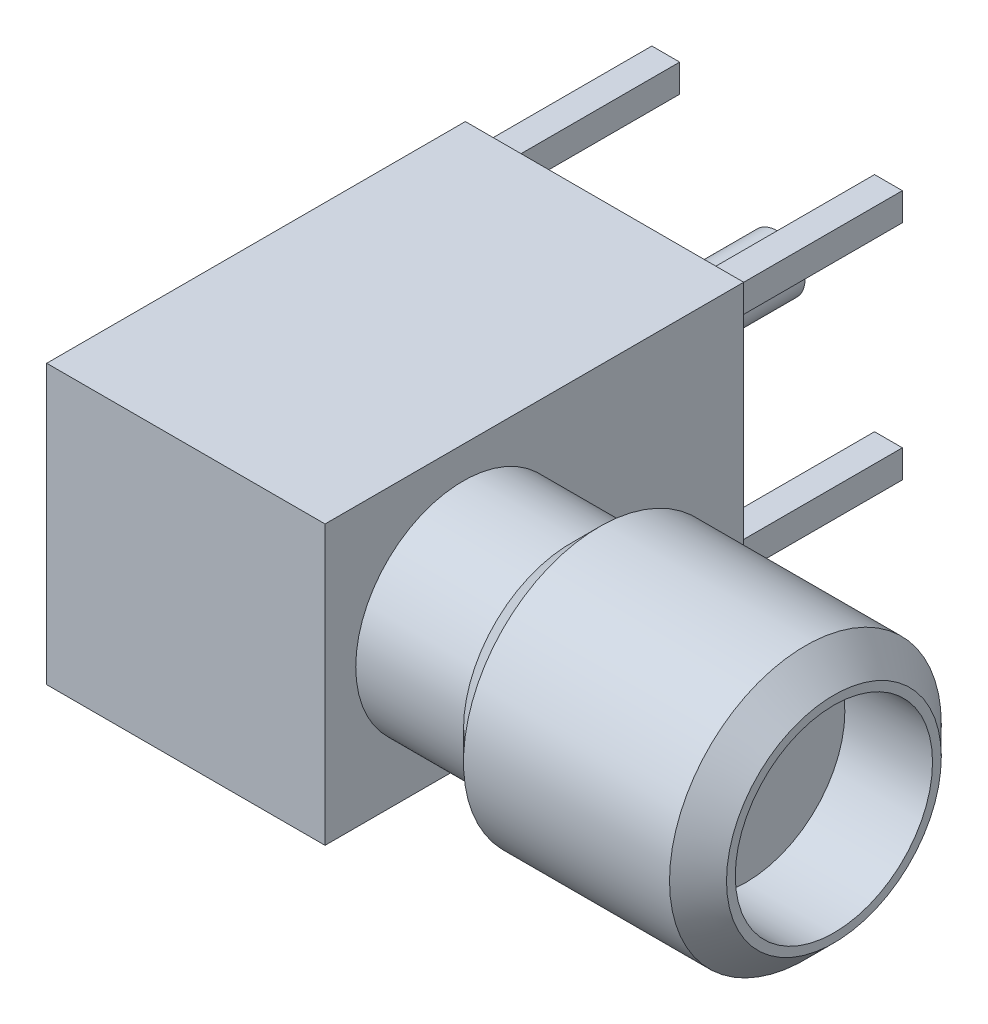
ISO-10303-21;
HEADER;
FILE_DESCRIPTION(('STEP AP214'),'2;1');
FILE_NAME('part.step','',(''),(''),'','','');
FILE_SCHEMA(('AUTOMOTIVE_DESIGN { 1 0 10303 214 1 1 1 1 }'));
ENDSEC;
DATA;
#1=APPLICATION_CONTEXT('core data for automotive mechanical design processes');
#2=APPLICATION_PROTOCOL_DEFINITION('international standard','automotive_design',2000,#1);
#3=PRODUCT_CONTEXT('',#1,'mechanical');
#4=PRODUCT('Part','Part','',(#3));
#5=PRODUCT_RELATED_PRODUCT_CATEGORY('part','',(#4));
#6=PRODUCT_DEFINITION_FORMATION('','',#4);
#7=PRODUCT_DEFINITION_CONTEXT('part definition',#1,'design');
#8=PRODUCT_DEFINITION('design','',#6,#7);
#9=PRODUCT_DEFINITION_SHAPE('','',#8);
#10=(LENGTH_UNIT() NAMED_UNIT(*) SI_UNIT(.MILLI.,.METRE.));
#11=(NAMED_UNIT(*) PLANE_ANGLE_UNIT() SI_UNIT($,.RADIAN.));
#12=(NAMED_UNIT(*) SI_UNIT($,.STERADIAN.) SOLID_ANGLE_UNIT());
#13=UNCERTAINTY_MEASURE_WITH_UNIT(LENGTH_MEASURE(1.E-05),#10,'distance_accuracy_value','');
#14=(GEOMETRIC_REPRESENTATION_CONTEXT(3) GLOBAL_UNCERTAINTY_ASSIGNED_CONTEXT((#13)) GLOBAL_UNIT_ASSIGNED_CONTEXT((#10,
#11,#12)) REPRESENTATION_CONTEXT('',''));
#15=CARTESIAN_POINT('',(0.,0.,0.));
#16=DIRECTION('',(0.,0.,1.));
#17=DIRECTION('',(1.,0.,0.));
#18=AXIS2_PLACEMENT_3D('',#15,#16,#17);
#19=CARTESIAN_POINT('',(8.6332,0.,6.4008));
#20=DIRECTION('',(-1.,0.,0.));
#21=DIRECTION('',(0.,0.,1.));
#22=AXIS2_PLACEMENT_3D('',#19,#20,#21);
#23=PLANE('',#22);
#24=CARTESIAN_POINT('',(8.6332,0.,6.4008));
#25=DIRECTION('',(-1.,0.,0.));
#26=DIRECTION('',(0.,0.,1.));
#27=AXIS2_PLACEMENT_3D('',#24,#25,#26);
#28=CIRCLE('',#27,0.5);
#29=CARTESIAN_POINT('',(8.6332,0.,6.9008));
#30=VERTEX_POINT('',#29);
#31=EDGE_CURVE('E20',#30,#30,#28,.F.);
#32=ORIENTED_EDGE('',*,*,#31,.T.);
#33=EDGE_LOOP('',(#32));
#34=FACE_BOUND('',#33,.T.);
#35=ADVANCED_FACE('F17',(#34),#23,.F.);
#36=CARTESIAN_POINT('',(9.6332,0.,6.4008));
#37=DIRECTION('',(-1.,0.,0.));
#38=DIRECTION('',(0.,0.,1.));
#39=AXIS2_PLACEMENT_3D('',#36,#37,#38);
#40=CYLINDRICAL_SURFACE('',#39,0.5);
#41=CARTESIAN_POINT('',(9.6332,0.,6.4008));
#42=DIRECTION('',(-1.,0.,0.));
#43=DIRECTION('',(0.,0.,1.));
#44=AXIS2_PLACEMENT_3D('',#41,#42,#43);
#45=CIRCLE('',#44,0.5);
#46=CARTESIAN_POINT('',(9.6332,0.,6.9008));
#47=VERTEX_POINT('',#46);
#48=EDGE_CURVE('E218',#47,#47,#45,.F.);
#49=ORIENTED_EDGE('',*,*,#48,.T.);
#50=EDGE_LOOP('',(#49));
#51=FACE_BOUND('',#50,.T.);
#52=ORIENTED_EDGE('',*,*,#31,.F.);
#53=EDGE_LOOP('',(#52));
#54=FACE_BOUND('',#53,.T.);
#55=ADVANCED_FACE('F226',(#51,#54),#40,.F.);
#56=CARTESIAN_POINT('',(9.6332,0.,6.4008));
#57=DIRECTION('',(-1.,0.,0.));
#58=DIRECTION('',(0.,0.,1.));
#59=AXIS2_PLACEMENT_3D('',#56,#57,#58);
#60=PLANE('',#59);
#61=ORIENTED_EDGE('',*,*,#48,.F.);
#62=EDGE_LOOP('',(#61));
#63=FACE_BOUND('',#62,.T.);
#64=CARTESIAN_POINT('',(9.6332,0.,6.4008));
#65=DIRECTION('',(1.,0.,0.));
#66=DIRECTION('',(0.,0.,-1.));
#67=AXIS2_PLACEMENT_3D('',#64,#65,#66);
#68=CIRCLE('',#67,2.25);
#69=CARTESIAN_POINT('',(9.6332,0.,4.1508));
#70=VERTEX_POINT('',#69);
#71=EDGE_CURVE('E216',#70,#70,#68,.T.);
#72=ORIENTED_EDGE('',*,*,#71,.T.);
#73=EDGE_LOOP('',(#72));
#74=FACE_BOUND('',#73,.T.);
#75=ADVANCED_FACE('F228',(#63,#74),#60,.F.);
#76=CARTESIAN_POINT('',(9.6332,0.,6.4008));
#77=DIRECTION('',(1.,0.,0.));
#78=DIRECTION('',(0.,0.,-1.));
#79=AXIS2_PLACEMENT_3D('',#76,#77,#78);
#80=CYLINDRICAL_SURFACE('',#79,2.25);
#81=ORIENTED_EDGE('',*,*,#71,.F.);
#82=EDGE_LOOP('',(#81));
#83=FACE_BOUND('',#82,.T.);
#84=CARTESIAN_POINT('',(11.6332,0.,6.4008));
#85=DIRECTION('',(1.,0.,0.));
#86=DIRECTION('',(0.,0.,-1.));
#87=AXIS2_PLACEMENT_3D('',#84,#85,#86);
#88=CIRCLE('',#87,2.25);
#89=CARTESIAN_POINT('',(11.6332,0.,4.1508));
#90=VERTEX_POINT('',#89);
#91=EDGE_CURVE('E213',#90,#90,#88,.F.);
#92=ORIENTED_EDGE('',*,*,#91,.F.);
#93=EDGE_LOOP('',(#92));
#94=FACE_BOUND('',#93,.T.);
#95=ADVANCED_FACE('F234',(#83,#94),#80,.F.);
#96=CARTESIAN_POINT('',(11.6332,0.,6.4008));
#97=DIRECTION('',(1.,0.,0.));
#98=DIRECTION('',(0.,0.,-1.));
#99=AXIS2_PLACEMENT_3D('',#96,#97,#98);
#100=PLANE('',#99);
#101=CARTESIAN_POINT('',(11.6331999999488,0.,6.4008));
#102=DIRECTION('',(-1.,0.,0.));
#103=DIRECTION('',(0.,0.,1.));
#104=AXIS2_PLACEMENT_3D('',#101,#102,#103);
#105=CIRCLE('',#104,2.45000000000471);
#106=CARTESIAN_POINT('',(11.6331999999488,0.,8.85080000000471));
#107=VERTEX_POINT('',#106);
#108=EDGE_CURVE('E196',#107,#107,#105,.T.);
#109=ORIENTED_EDGE('',*,*,#108,.F.);
#110=EDGE_LOOP('',(#109));
#111=FACE_BOUND('',#110,.T.);
#112=ORIENTED_EDGE('',*,*,#91,.T.);
#113=EDGE_LOOP('',(#112));
#114=FACE_BOUND('',#113,.T.);
#115=ADVANCED_FACE('F362',(#111,#114),#100,.T.);
#116=CARTESIAN_POINT('',(10.9832000000551,0.,6.4008));
#117=DIRECTION('',(-1.,0.,0.));
#118=DIRECTION('',(0.,0.,1.));
#119=AXIS2_PLACEMENT_3D('',#116,#117,#118);
#120=CONICAL_SURFACE('',#119,3.09999999989839,0.785398163397448);
#121=ORIENTED_EDGE('',*,*,#108,.T.);
#122=EDGE_LOOP('',(#121));
#123=FACE_BOUND('',#122,.T.);
#124=CARTESIAN_POINT('',(10.9832,0.,6.4008));
#125=DIRECTION('',(1.,0.,0.));
#126=DIRECTION('',(0.,0.,-1.));
#127=AXIS2_PLACEMENT_3D('',#124,#125,#126);
#128=CIRCLE('',#127,3.1);
#129=CARTESIAN_POINT('',(10.9832,0.,3.3008));
#130=VERTEX_POINT('',#129);
#131=EDGE_CURVE('E171',#130,#130,#128,.F.);
#132=ORIENTED_EDGE('',*,*,#131,.F.);
#133=EDGE_LOOP('',(#132));
#134=FACE_BOUND('',#133,.T.);
#135=ADVANCED_FACE('F358',(#123,#134),#120,.T.);
#136=CARTESIAN_POINT('',(5.6332,0.,6.4008));
#137=DIRECTION('',(1.,0.,0.));
#138=DIRECTION('',(0.,0.,-1.));
#139=AXIS2_PLACEMENT_3D('',#136,#137,#138);
#140=CYLINDRICAL_SURFACE('',#139,3.1);
#141=CARTESIAN_POINT('',(6.28319999998439,0.,6.4008));
#142=DIRECTION('',(1.,0.,0.));
#143=DIRECTION('',(0.,0.,-1.));
#144=AXIS2_PLACEMENT_3D('',#141,#142,#143);
#145=CIRCLE('',#144,3.10000000002321);
#146=CARTESIAN_POINT('',(6.28319999998439,0.,3.30079999997679));
#147=VERTEX_POINT('',#146);
#148=EDGE_CURVE('E164',#147,#147,#145,.F.);
#149=ORIENTED_EDGE('',*,*,#148,.F.);
#150=EDGE_LOOP('',(#149));
#151=FACE_BOUND('',#150,.T.);
#152=ORIENTED_EDGE('',*,*,#131,.T.);
#153=EDGE_LOOP('',(#152));
#154=FACE_BOUND('',#153,.T.);
#155=ADVANCED_FACE('F355',(#151,#154),#140,.T.);
#156=CARTESIAN_POINT('',(2.2225,-2.8575,-4.835025612107));
#157=DIRECTION('',(1.,0.,0.));
#158=DIRECTION('',(0.,0.,-1.));
#159=AXIS2_PLACEMENT_3D('',#156,#157,#158);
#160=PLANE('',#159);
#161=DIRECTION('',(0.,1.,0.));
#162=VECTOR('',#161,1.);
#163=CARTESIAN_POINT('',(2.2225,-3.155,-3.937));
#164=LINE('',#163,#162);
#165=CARTESIAN_POINT('',(2.2225,-2.2225,-3.937));
#166=VERTEX_POINT('',#165);
#167=CARTESIAN_POINT('',(2.2225,-2.8575,-3.937));
#168=VERTEX_POINT('',#167);
#169=EDGE_CURVE('E178',#166,#168,#164,.F.);
#170=ORIENTED_EDGE('',*,*,#169,.T.);
#171=DIRECTION('',(0.,0.,1.));
#172=VECTOR('',#171,1.);
#173=CARTESIAN_POINT('',(2.2225,-2.8575,-4.835025612107));
#174=LINE('',#173,#172);
#175=CARTESIAN_POINT('',(2.2225,-2.8575,0.));
#176=VERTEX_POINT('',#175);
#177=EDGE_CURVE('E168',#168,#176,#174,.T.);
#178=ORIENTED_EDGE('',*,*,#177,.T.);
#179=DIRECTION('',(0.,1.,0.));
#180=VECTOR('',#179,1.);
#181=CARTESIAN_POINT('',(2.2225,-2.8575,0.));
#182=LINE('',#181,#180);
#183=CARTESIAN_POINT('',(2.2225,-2.2225,0.));
#184=VERTEX_POINT('',#183);
#185=EDGE_CURVE('E158',#184,#176,#182,.F.);
#186=ORIENTED_EDGE('',*,*,#185,.F.);
#187=DIRECTION('',(0.,0.,-1.));
#188=VECTOR('',#187,1.);
#189=CARTESIAN_POINT('',(2.2225,-2.2225,-4.835025612107));
#190=LINE('',#189,#188);
#191=EDGE_CURVE('E151',#184,#166,#190,.T.);
#192=ORIENTED_EDGE('',*,*,#191,.T.);
#193=EDGE_LOOP('',(#170,#178,#186,#192));
#194=FACE_BOUND('',#193,.T.);
#195=ADVANCED_FACE('F166',(#194),#160,.F.);
#196=CARTESIAN_POINT('',(-2.2225,2.8575,-4.835025612107));
#197=DIRECTION('',(-1.,0.,0.));
#198=DIRECTION('',(0.,0.,1.));
#199=AXIS2_PLACEMENT_3D('',#196,#197,#198);
#200=PLANE('',#199);
#201=DIRECTION('',(0.,1.,0.));
#202=VECTOR('',#201,1.);
#203=CARTESIAN_POINT('',(-2.2225,-3.155,-3.937));
#204=LINE('',#203,#202);
#205=CARTESIAN_POINT('',(-2.2225,2.2225,-3.937));
#206=VERTEX_POINT('',#205);
#207=CARTESIAN_POINT('',(-2.2225,2.8575,-3.937));
#208=VERTEX_POINT('',#207);
#209=EDGE_CURVE('E607',#206,#208,#204,.T.);
#210=ORIENTED_EDGE('',*,*,#209,.T.);
#211=DIRECTION('',(0.,0.,-1.));
#212=VECTOR('',#211,1.);
#213=CARTESIAN_POINT('',(-2.2225,2.8575,-4.835025612107));
#214=LINE('',#213,#212);
#215=CARTESIAN_POINT('',(-2.2225,2.8575,0.));
#216=VERTEX_POINT('',#215);
#217=EDGE_CURVE('E611',#208,#216,#214,.F.);
#218=ORIENTED_EDGE('',*,*,#217,.T.);
#219=DIRECTION('',(0.,1.,0.));
#220=VECTOR('',#219,1.);
#221=CARTESIAN_POINT('',(-2.2225,2.8575,0.));
#222=LINE('',#221,#220);
#223=CARTESIAN_POINT('',(-2.2225,2.2225,0.));
#224=VERTEX_POINT('',#223);
#225=EDGE_CURVE('E170',#224,#216,#222,.T.);
#226=ORIENTED_EDGE('',*,*,#225,.F.);
#227=DIRECTION('',(0.,0.,1.));
#228=VECTOR('',#227,1.);
#229=CARTESIAN_POINT('',(-2.2225,2.2225,-4.835025612107));
#230=LINE('',#229,#228);
#231=EDGE_CURVE('E614',#224,#206,#230,.F.);
#232=ORIENTED_EDGE('',*,*,#231,.T.);
#233=EDGE_LOOP('',(#210,#218,#226,#232));
#234=FACE_BOUND('',#233,.T.);
#235=ADVANCED_FACE('F348',(#234),#200,.F.);
#236=CARTESIAN_POINT('',(2.8575,2.2225,-4.835025612107));
#237=DIRECTION('',(0.,1.,0.));
#238=DIRECTION('',(0.,0.,1.));
#239=AXIS2_PLACEMENT_3D('',#236,#237,#238);
#240=PLANE('',#239);
#241=DIRECTION('',(1.,0.,0.));
#242=VECTOR('',#241,1.);
#243=CARTESIAN_POINT('',(-3.155,2.2225,-3.937));
#244=LINE('',#243,#242);
#245=CARTESIAN_POINT('',(2.2225,2.2225,-3.937));
#246=VERTEX_POINT('',#245);
#247=CARTESIAN_POINT('',(2.8575,2.2225,-3.937));
#248=VERTEX_POINT('',#247);
#249=EDGE_CURVE('E698',#246,#248,#244,.T.);
#250=ORIENTED_EDGE('',*,*,#249,.T.);
#251=DIRECTION('',(0.,0.,1.));
#252=VECTOR('',#251,1.);
#253=CARTESIAN_POINT('',(2.8575,2.2225,-4.835025612107));
#254=LINE('',#253,#252);
#255=CARTESIAN_POINT('',(2.8575,2.2225,0.));
#256=VERTEX_POINT('',#255);
#257=EDGE_CURVE('E690',#248,#256,#254,.T.);
#258=ORIENTED_EDGE('',*,*,#257,.T.);
#259=DIRECTION('',(1.,0.,0.));
#260=VECTOR('',#259,1.);
#261=CARTESIAN_POINT('',(2.8575,2.2225,0.));
#262=LINE('',#261,#260);
#263=CARTESIAN_POINT('',(2.2225,2.2225,0.));
#264=VERTEX_POINT('',#263);
#265=EDGE_CURVE('E189',#264,#256,#262,.T.);
#266=ORIENTED_EDGE('',*,*,#265,.F.);
#267=DIRECTION('',(0.,0.,-1.));
#268=VECTOR('',#267,1.);
#269=CARTESIAN_POINT('',(2.2225,2.2225,-4.835025612107));
#270=LINE('',#269,#268);
#271=EDGE_CURVE('E629',#264,#246,#270,.T.);
#272=ORIENTED_EDGE('',*,*,#271,.T.);
#273=EDGE_LOOP('',(#250,#258,#266,#272));
#274=FACE_BOUND('',#273,.T.);
#275=ADVANCED_FACE('F344',(#274),#240,.F.);
#276=CARTESIAN_POINT('',(-2.8575,-2.2225,-4.835025612107));
#277=DIRECTION('',(0.,-1.,0.));
#278=DIRECTION('',(0.,0.,-1.));
#279=AXIS2_PLACEMENT_3D('',#276,#277,#278);
#280=PLANE('',#279);
#281=DIRECTION('',(1.,0.,0.));
#282=VECTOR('',#281,1.);
#283=CARTESIAN_POINT('',(-3.155,-2.2225,-3.937));
#284=LINE('',#283,#282);
#285=CARTESIAN_POINT('',(-2.2225,-2.2225,-3.937));
#286=VERTEX_POINT('',#285);
#287=CARTESIAN_POINT('',(-2.8575,-2.2225,-3.937));
#288=VERTEX_POINT('',#287);
#289=EDGE_CURVE('E681',#286,#288,#284,.F.);
#290=ORIENTED_EDGE('',*,*,#289,.T.);
#291=DIRECTION('',(0.,0.,-1.));
#292=VECTOR('',#291,1.);
#293=CARTESIAN_POINT('',(-2.8575,-2.2225,-4.835025612107));
#294=LINE('',#293,#292);
#295=CARTESIAN_POINT('',(-2.8575,-2.2225,0.));
#296=VERTEX_POINT('',#295);
#297=EDGE_CURVE('E186',#288,#296,#294,.F.);
#298=ORIENTED_EDGE('',*,*,#297,.T.);
#299=DIRECTION('',(1.,0.,0.));
#300=VECTOR('',#299,1.);
#301=CARTESIAN_POINT('',(-2.8575,-2.2225,0.));
#302=LINE('',#301,#300);
#303=CARTESIAN_POINT('',(-2.2225,-2.2225,0.));
#304=VERTEX_POINT('',#303);
#305=EDGE_CURVE('E187',#304,#296,#302,.F.);
#306=ORIENTED_EDGE('',*,*,#305,.F.);
#307=DIRECTION('',(0.,0.,1.));
#308=VECTOR('',#307,1.);
#309=CARTESIAN_POINT('',(-2.2225,-2.2225,-4.835025612107));
#310=LINE('',#309,#308);
#311=EDGE_CURVE('E686',#304,#286,#310,.F.);
#312=ORIENTED_EDGE('',*,*,#311,.T.);
#313=EDGE_LOOP('',(#290,#298,#306,#312));
#314=FACE_BOUND('',#313,.T.);
#315=ADVANCED_FACE('F340',(#314),#280,.F.);
#316=CARTESIAN_POINT('',(6.28320000015492,0.,6.4008));
#317=DIRECTION('',(1.,0.,0.));
#318=DIRECTION('',(0.,1.,0.));
#319=AXIS2_PLACEMENT_3D('',#316,#317,#318);
#320=CONICAL_SURFACE('',#319,3.10000000019374,0.785398163397448);
#321=CARTESIAN_POINT('',(5.6332,0.,6.4008));
#322=DIRECTION('',(1.,0.,0.));
#323=DIRECTION('',(0.,0.,-1.));
#324=AXIS2_PLACEMENT_3D('',#321,#322,#323);
#325=CIRCLE('',#324,2.45);
#326=CARTESIAN_POINT('',(5.6332,0.,3.9508));
#327=VERTEX_POINT('',#326);
#328=EDGE_CURVE('E182',#327,#327,#325,.F.);
#329=ORIENTED_EDGE('',*,*,#328,.F.);
#330=EDGE_LOOP('',(#329));
#331=FACE_BOUND('',#330,.T.);
#332=ORIENTED_EDGE('',*,*,#148,.T.);
#333=EDGE_LOOP('',(#332));
#334=FACE_BOUND('',#333,.T.);
#335=ADVANCED_FACE('F337',(#331,#334),#320,.T.);
#336=CARTESIAN_POINT('',(2.8575,-2.2225,-4.835025612107));
#337=DIRECTION('',(0.,-1.,0.));
#338=DIRECTION('',(0.,0.,-1.));
#339=AXIS2_PLACEMENT_3D('',#336,#337,#338);
#340=PLANE('',#339);
#341=DIRECTION('',(1.,0.,0.));
#342=VECTOR('',#341,1.);
#343=CARTESIAN_POINT('',(-3.155,-2.2225,-3.937));
#344=LINE('',#343,#342);
#345=CARTESIAN_POINT('',(2.8575,-2.2225,-3.937));
#346=VERTEX_POINT('',#345);
#347=EDGE_CURVE('E175',#346,#166,#344,.F.);
#348=ORIENTED_EDGE('',*,*,#347,.T.);
#349=ORIENTED_EDGE('',*,*,#191,.F.);
#350=DIRECTION('',(1.,0.,0.));
#351=VECTOR('',#350,1.);
#352=CARTESIAN_POINT('',(2.8575,-2.2225,0.));
#353=LINE('',#352,#351);
#354=CARTESIAN_POINT('',(2.8575,-2.2225,0.));
#355=VERTEX_POINT('',#354);
#356=EDGE_CURVE('E156',#355,#184,#353,.F.);
#357=ORIENTED_EDGE('',*,*,#356,.F.);
#358=DIRECTION('',(0.,0.,1.));
#359=VECTOR('',#358,1.);
#360=CARTESIAN_POINT('',(2.8575,-2.2225,-4.835025612107));
#361=LINE('',#360,#359);
#362=EDGE_CURVE('E185',#355,#346,#361,.F.);
#363=ORIENTED_EDGE('',*,*,#362,.T.);
#364=EDGE_LOOP('',(#348,#349,#357,#363));
#365=FACE_BOUND('',#364,.T.);
#366=ADVANCED_FACE('F173',(#365),#340,.F.);
#367=CARTESIAN_POINT('',(-3.155,-3.155,-3.937));
#368=DIRECTION('',(0.,0.,1.));
#369=DIRECTION('',(1.,0.,0.));
#370=AXIS2_PLACEMENT_3D('',#367,#368,#369);
#371=PLANE('',#370);
#372=ORIENTED_EDGE('',*,*,#347,.F.);
#373=DIRECTION('',(0.,1.,0.));
#374=VECTOR('',#373,1.);
#375=CARTESIAN_POINT('',(2.8575,-2.8575,-3.937));
#376=LINE('',#375,#374);
#377=CARTESIAN_POINT('',(2.8575,-2.8575,-3.937));
#378=VERTEX_POINT('',#377);
#379=EDGE_CURVE('E645',#346,#378,#376,.F.);
#380=ORIENTED_EDGE('',*,*,#379,.T.);
#381=DIRECTION('',(1.,0.,0.));
#382=VECTOR('',#381,1.);
#383=CARTESIAN_POINT('',(2.8575,-2.8575,-3.937));
#384=LINE('',#383,#382);
#385=EDGE_CURVE('E639',#378,#168,#384,.F.);
#386=ORIENTED_EDGE('',*,*,#385,.T.);
#387=ORIENTED_EDGE('',*,*,#169,.F.);
#388=EDGE_LOOP('',(#372,#380,#386,#387));
#389=FACE_BOUND('',#388,.T.);
#390=ADVANCED_FACE('F330',(#389),#371,.F.);
#391=CARTESIAN_POINT('',(2.8575,-2.8575,-4.835025612107));
#392=DIRECTION('',(0.,1.,0.));
#393=DIRECTION('',(0.,0.,1.));
#394=AXIS2_PLACEMENT_3D('',#391,#392,#393);
#395=PLANE('',#394);
#396=ORIENTED_EDGE('',*,*,#385,.F.);
#397=DIRECTION('',(0.,0.,1.));
#398=VECTOR('',#397,1.);
#399=CARTESIAN_POINT('',(2.8575,-2.8575,-4.835025612107));
#400=LINE('',#399,#398);
#401=CARTESIAN_POINT('',(2.8575,-2.8575,0.));
#402=VERTEX_POINT('',#401);
#403=EDGE_CURVE('E648',#378,#402,#400,.T.);
#404=ORIENTED_EDGE('',*,*,#403,.T.);
#405=DIRECTION('',(1.,0.,0.));
#406=VECTOR('',#405,1.);
#407=CARTESIAN_POINT('',(2.8575,-2.8575,0.));
#408=LINE('',#407,#406);
#409=EDGE_CURVE('E642',#176,#402,#408,.T.);
#410=ORIENTED_EDGE('',*,*,#409,.F.);
#411=ORIENTED_EDGE('',*,*,#177,.F.);
#412=EDGE_LOOP('',(#396,#404,#410,#411));
#413=FACE_BOUND('',#412,.T.);
#414=ADVANCED_FACE('F326',(#413),#395,.F.);
#415=CARTESIAN_POINT('',(-2.8575,2.2225,-4.835025612107));
#416=DIRECTION('',(0.,1.,0.));
#417=DIRECTION('',(0.,0.,1.));
#418=AXIS2_PLACEMENT_3D('',#415,#416,#417);
#419=PLANE('',#418);
#420=DIRECTION('',(1.,0.,0.));
#421=VECTOR('',#420,1.);
#422=CARTESIAN_POINT('',(-3.155,2.2225,-3.937));
#423=LINE('',#422,#421);
#424=CARTESIAN_POINT('',(-2.8575,2.2225,-3.937));
#425=VERTEX_POINT('',#424);
#426=EDGE_CURVE('E618',#425,#206,#423,.T.);
#427=ORIENTED_EDGE('',*,*,#426,.T.);
#428=ORIENTED_EDGE('',*,*,#231,.F.);
#429=DIRECTION('',(1.,0.,0.));
#430=VECTOR('',#429,1.);
#431=CARTESIAN_POINT('',(-2.8575,2.2225,0.));
#432=LINE('',#431,#430);
#433=CARTESIAN_POINT('',(-2.8575,2.2225,0.));
#434=VERTEX_POINT('',#433);
#435=EDGE_CURVE('E636',#434,#224,#432,.T.);
#436=ORIENTED_EDGE('',*,*,#435,.F.);
#437=DIRECTION('',(0.,0.,-1.));
#438=VECTOR('',#437,1.);
#439=CARTESIAN_POINT('',(-2.8575,2.2225,-4.835025612107));
#440=LINE('',#439,#438);
#441=EDGE_CURVE('E649',#434,#425,#440,.T.);
#442=ORIENTED_EDGE('',*,*,#441,.T.);
#443=EDGE_LOOP('',(#427,#428,#436,#442));
#444=FACE_BOUND('',#443,.T.);
#445=ADVANCED_FACE('F322',(#444),#419,.F.);
#446=CARTESIAN_POINT('',(-3.155,-3.155,-3.937));
#447=DIRECTION('',(0.,0.,1.));
#448=DIRECTION('',(1.,0.,0.));
#449=AXIS2_PLACEMENT_3D('',#446,#447,#448);
#450=PLANE('',#449);
#451=ORIENTED_EDGE('',*,*,#426,.F.);
#452=DIRECTION('',(0.,1.,0.));
#453=VECTOR('',#452,1.);
#454=CARTESIAN_POINT('',(-2.8575,2.8575,-3.937));
#455=LINE('',#454,#453);
#456=CARTESIAN_POINT('',(-2.8575,2.8575,-3.937));
#457=VERTEX_POINT('',#456);
#458=EDGE_CURVE('E623',#425,#457,#455,.T.);
#459=ORIENTED_EDGE('',*,*,#458,.T.);
#460=DIRECTION('',(1.,0.,0.));
#461=VECTOR('',#460,1.);
#462=CARTESIAN_POINT('',(-2.8575,2.8575,-3.937));
#463=LINE('',#462,#461);
#464=EDGE_CURVE('E621',#457,#208,#463,.T.);
#465=ORIENTED_EDGE('',*,*,#464,.T.);
#466=ORIENTED_EDGE('',*,*,#209,.F.);
#467=EDGE_LOOP('',(#451,#459,#465,#466));
#468=FACE_BOUND('',#467,.T.);
#469=ADVANCED_FACE('F318',(#468),#450,.F.);
#470=CARTESIAN_POINT('',(-2.8575,2.8575,-4.835025612107));
#471=DIRECTION('',(0.,-1.,0.));
#472=DIRECTION('',(0.,0.,-1.));
#473=AXIS2_PLACEMENT_3D('',#470,#471,#472);
#474=PLANE('',#473);
#475=ORIENTED_EDGE('',*,*,#464,.F.);
#476=DIRECTION('',(0.,0.,-1.));
#477=VECTOR('',#476,1.);
#478=CARTESIAN_POINT('',(-2.8575,2.8575,-4.835025612107));
#479=LINE('',#478,#477);
#480=CARTESIAN_POINT('',(-2.8575,2.8575,0.));
#481=VERTEX_POINT('',#480);
#482=EDGE_CURVE('E210',#457,#481,#479,.F.);
#483=ORIENTED_EDGE('',*,*,#482,.T.);
#484=DIRECTION('',(1.,0.,0.));
#485=VECTOR('',#484,1.);
#486=CARTESIAN_POINT('',(-2.8575,2.8575,0.));
#487=LINE('',#486,#485);
#488=EDGE_CURVE('E617',#216,#481,#487,.F.);
#489=ORIENTED_EDGE('',*,*,#488,.F.);
#490=ORIENTED_EDGE('',*,*,#217,.F.);
#491=EDGE_LOOP('',(#475,#483,#489,#490));
#492=FACE_BOUND('',#491,.T.);
#493=ADVANCED_FACE('F314',(#492),#474,.F.);
#494=CARTESIAN_POINT('',(-3.155,-3.155,-3.937));
#495=DIRECTION('',(0.,0.,1.));
#496=DIRECTION('',(1.,0.,0.));
#497=AXIS2_PLACEMENT_3D('',#494,#495,#496);
#498=PLANE('',#497);
#499=CARTESIAN_POINT('',(0.,0.,-3.937));
#500=DIRECTION('',(0.,0.,-1.));
#501=DIRECTION('',(-1.,0.,0.));
#502=AXIS2_PLACEMENT_3D('',#499,#500,#501);
#503=CIRCLE('',#502,0.6375);
#504=CARTESIAN_POINT('',(-0.6375,0.,-3.937));
#505=VERTEX_POINT('',#504);
#506=EDGE_CURVE('E206',#505,#505,#503,.F.);
#507=ORIENTED_EDGE('',*,*,#506,.F.);
#508=EDGE_LOOP('',(#507));
#509=FACE_BOUND('',#508,.T.);
#510=ADVANCED_FACE('F310',(#509),#498,.F.);
#511=CARTESIAN_POINT('',(2.2225,2.8575,-4.835025612107));
#512=DIRECTION('',(1.,0.,0.));
#513=DIRECTION('',(0.,0.,-1.));
#514=AXIS2_PLACEMENT_3D('',#511,#512,#513);
#515=PLANE('',#514);
#516=DIRECTION('',(0.,1.,0.));
#517=VECTOR('',#516,1.);
#518=CARTESIAN_POINT('',(2.2225,-3.155,-3.937));
#519=LINE('',#518,#517);
#520=CARTESIAN_POINT('',(2.2225,2.8575,-3.937));
#521=VERTEX_POINT('',#520);
#522=EDGE_CURVE('E700',#521,#246,#519,.F.);
#523=ORIENTED_EDGE('',*,*,#522,.T.);
#524=ORIENTED_EDGE('',*,*,#271,.F.);
#525=DIRECTION('',(0.,1.,0.));
#526=VECTOR('',#525,1.);
#527=CARTESIAN_POINT('',(2.2225,2.8575,0.));
#528=LINE('',#527,#526);
#529=CARTESIAN_POINT('',(2.2225,2.8575,0.));
#530=VERTEX_POINT('',#529);
#531=EDGE_CURVE('E627',#530,#264,#528,.F.);
#532=ORIENTED_EDGE('',*,*,#531,.F.);
#533=DIRECTION('',(0.,0.,-1.));
#534=VECTOR('',#533,1.);
#535=CARTESIAN_POINT('',(2.2225,2.8575,-4.835025612107));
#536=LINE('',#535,#534);
#537=EDGE_CURVE('E209',#530,#521,#536,.T.);
#538=ORIENTED_EDGE('',*,*,#537,.T.);
#539=EDGE_LOOP('',(#523,#524,#532,#538));
#540=FACE_BOUND('',#539,.T.);
#541=ADVANCED_FACE('F306',(#540),#515,.F.);
#542=CARTESIAN_POINT('',(-3.155,-3.155,-3.937));
#543=DIRECTION('',(0.,0.,1.));
#544=DIRECTION('',(1.,0.,0.));
#545=AXIS2_PLACEMENT_3D('',#542,#543,#544);
#546=PLANE('',#545);
#547=ORIENTED_EDGE('',*,*,#522,.F.);
#548=DIRECTION('',(1.,0.,0.));
#549=VECTOR('',#548,1.);
#550=CARTESIAN_POINT('',(2.8575,2.8575,-3.937));
#551=LINE('',#550,#549);
#552=CARTESIAN_POINT('',(2.8575,2.8575,-3.937));
#553=VERTEX_POINT('',#552);
#554=EDGE_CURVE('E666',#521,#553,#551,.T.);
#555=ORIENTED_EDGE('',*,*,#554,.T.);
#556=DIRECTION('',(0.,1.,0.));
#557=VECTOR('',#556,1.);
#558=CARTESIAN_POINT('',(2.8575,2.8575,-3.937));
#559=LINE('',#558,#557);
#560=EDGE_CURVE('E693',#553,#248,#559,.F.);
#561=ORIENTED_EDGE('',*,*,#560,.T.);
#562=ORIENTED_EDGE('',*,*,#249,.F.);
#563=EDGE_LOOP('',(#547,#555,#561,#562));
#564=FACE_BOUND('',#563,.T.);
#565=ADVANCED_FACE('F302',(#564),#546,.F.);
#566=CARTESIAN_POINT('',(2.8575,2.8575,-4.835025612107));
#567=DIRECTION('',(-1.,0.,0.));
#568=DIRECTION('',(0.,0.,1.));
#569=AXIS2_PLACEMENT_3D('',#566,#567,#568);
#570=PLANE('',#569);
#571=ORIENTED_EDGE('',*,*,#560,.F.);
#572=DIRECTION('',(0.,0.,-1.));
#573=VECTOR('',#572,1.);
#574=CARTESIAN_POINT('',(2.8575,2.8575,-4.835025612107));
#575=LINE('',#574,#573);
#576=CARTESIAN_POINT('',(2.8575,2.8575,0.));
#577=VERTEX_POINT('',#576);
#578=EDGE_CURVE('E663',#553,#577,#575,.F.);
#579=ORIENTED_EDGE('',*,*,#578,.T.);
#580=DIRECTION('',(0.,1.,0.));
#581=VECTOR('',#580,1.);
#582=CARTESIAN_POINT('',(2.8575,2.8575,0.));
#583=LINE('',#582,#581);
#584=EDGE_CURVE('E696',#256,#577,#583,.T.);
#585=ORIENTED_EDGE('',*,*,#584,.F.);
#586=ORIENTED_EDGE('',*,*,#257,.F.);
#587=EDGE_LOOP('',(#571,#579,#585,#586));
#588=FACE_BOUND('',#587,.T.);
#589=ADVANCED_FACE('F298',(#588),#570,.F.);
#590=CARTESIAN_POINT('',(-2.2225,-2.8575,-4.835025612107));
#591=DIRECTION('',(-1.,0.,0.));
#592=DIRECTION('',(0.,0.,1.));
#593=AXIS2_PLACEMENT_3D('',#590,#591,#592);
#594=PLANE('',#593);
#595=DIRECTION('',(0.,1.,0.));
#596=VECTOR('',#595,1.);
#597=CARTESIAN_POINT('',(-2.2225,-3.155,-3.937));
#598=LINE('',#597,#596);
#599=CARTESIAN_POINT('',(-2.2225,-2.8575,-3.937));
#600=VERTEX_POINT('',#599);
#601=EDGE_CURVE('E683',#600,#286,#598,.T.);
#602=ORIENTED_EDGE('',*,*,#601,.T.);
#603=ORIENTED_EDGE('',*,*,#311,.F.);
#604=DIRECTION('',(0.,1.,0.));
#605=VECTOR('',#604,1.);
#606=CARTESIAN_POINT('',(-2.2225,-2.8575,0.));
#607=LINE('',#606,#605);
#608=CARTESIAN_POINT('',(-2.2225,-2.8575,0.));
#609=VERTEX_POINT('',#608);
#610=EDGE_CURVE('E688',#609,#304,#607,.T.);
#611=ORIENTED_EDGE('',*,*,#610,.F.);
#612=DIRECTION('',(0.,0.,1.));
#613=VECTOR('',#612,1.);
#614=CARTESIAN_POINT('',(-2.2225,-2.8575,-4.835025612107));
#615=LINE('',#614,#613);
#616=EDGE_CURVE('E661',#609,#600,#615,.F.);
#617=ORIENTED_EDGE('',*,*,#616,.T.);
#618=EDGE_LOOP('',(#602,#603,#611,#617));
#619=FACE_BOUND('',#618,.T.);
#620=ADVANCED_FACE('F294',(#619),#594,.F.);
#621=CARTESIAN_POINT('',(-3.155,-3.155,-3.937));
#622=DIRECTION('',(0.,0.,1.));
#623=DIRECTION('',(1.,0.,0.));
#624=AXIS2_PLACEMENT_3D('',#621,#622,#623);
#625=PLANE('',#624);
#626=ORIENTED_EDGE('',*,*,#601,.F.);
#627=DIRECTION('',(1.,0.,0.));
#628=VECTOR('',#627,1.);
#629=CARTESIAN_POINT('',(-2.8575,-2.8575,-3.937));
#630=LINE('',#629,#628);
#631=CARTESIAN_POINT('',(-2.8575,-2.8575,-3.937));
#632=VERTEX_POINT('',#631);
#633=EDGE_CURVE('E659',#600,#632,#630,.F.);
#634=ORIENTED_EDGE('',*,*,#633,.T.);
#635=DIRECTION('',(0.,1.,0.));
#636=VECTOR('',#635,1.);
#637=CARTESIAN_POINT('',(-2.8575,-2.8575,-3.937));
#638=LINE('',#637,#636);
#639=EDGE_CURVE('E676',#632,#288,#638,.T.);
#640=ORIENTED_EDGE('',*,*,#639,.T.);
#641=ORIENTED_EDGE('',*,*,#289,.F.);
#642=EDGE_LOOP('',(#626,#634,#640,#641));
#643=FACE_BOUND('',#642,.T.);
#644=ADVANCED_FACE('F290',(#643),#625,.F.);
#645=CARTESIAN_POINT('',(-2.8575,-2.8575,-4.835025612107));
#646=DIRECTION('',(1.,0.,0.));
#647=DIRECTION('',(0.,0.,-1.));
#648=AXIS2_PLACEMENT_3D('',#645,#646,#647);
#649=PLANE('',#648);
#650=ORIENTED_EDGE('',*,*,#639,.F.);
#651=DIRECTION('',(0.,0.,1.));
#652=VECTOR('',#651,1.);
#653=CARTESIAN_POINT('',(-2.8575,-2.8575,-4.835025612107));
#654=LINE('',#653,#652);
#655=CARTESIAN_POINT('',(-2.8575,-2.8575,0.));
#656=VERTEX_POINT('',#655);
#657=EDGE_CURVE('E205',#632,#656,#654,.T.);
#658=ORIENTED_EDGE('',*,*,#657,.T.);
#659=DIRECTION('',(0.,1.,0.));
#660=VECTOR('',#659,1.);
#661=CARTESIAN_POINT('',(-2.8575,-2.8575,0.));
#662=LINE('',#661,#660);
#663=EDGE_CURVE('E679',#296,#656,#662,.F.);
#664=ORIENTED_EDGE('',*,*,#663,.F.);
#665=ORIENTED_EDGE('',*,*,#297,.F.);
#666=EDGE_LOOP('',(#650,#658,#664,#665));
#667=FACE_BOUND('',#666,.T.);
#668=ADVANCED_FACE('F286',(#667),#649,.F.);
#669=CARTESIAN_POINT('',(3.7832,0.,6.4008));
#670=DIRECTION('',(1.,0.,0.));
#671=DIRECTION('',(0.,0.,-1.));
#672=AXIS2_PLACEMENT_3D('',#669,#670,#671);
#673=CYLINDRICAL_SURFACE('',#672,2.45);
#674=CARTESIAN_POINT('',(3.175,0.,6.4008));
#675=DIRECTION('',(1.,0.,0.));
#676=DIRECTION('',(0.,0.,-1.));
#677=AXIS2_PLACEMENT_3D('',#674,#675,#676);
#678=CIRCLE('',#677,2.45);
#679=CARTESIAN_POINT('',(3.175,0.,3.9508));
#680=VERTEX_POINT('',#679);
#681=EDGE_CURVE('E202',#680,#680,#678,.F.);
#682=ORIENTED_EDGE('',*,*,#681,.F.);
#683=EDGE_LOOP('',(#682));
#684=FACE_BOUND('',#683,.T.);
#685=ORIENTED_EDGE('',*,*,#328,.T.);
#686=EDGE_LOOP('',(#685));
#687=FACE_BOUND('',#686,.T.);
#688=ADVANCED_FACE('F282',(#684,#687),#673,.T.);
#689=CARTESIAN_POINT('',(2.8575,-2.8575,-4.835025612107));
#690=DIRECTION('',(-1.,0.,0.));
#691=DIRECTION('',(0.,0.,1.));
#692=AXIS2_PLACEMENT_3D('',#689,#690,#691);
#693=PLANE('',#692);
#694=ORIENTED_EDGE('',*,*,#379,.F.);
#695=ORIENTED_EDGE('',*,*,#362,.F.);
#696=DIRECTION('',(0.,1.,0.));
#697=VECTOR('',#696,1.);
#698=CARTESIAN_POINT('',(2.8575,-3.155,0.));
#699=LINE('',#698,#697);
#700=EDGE_CURVE('E161',#355,#402,#699,.F.);
#701=ORIENTED_EDGE('',*,*,#700,.T.);
#702=ORIENTED_EDGE('',*,*,#403,.F.);
#703=EDGE_LOOP('',(#694,#695,#701,#702));
#704=FACE_BOUND('',#703,.T.);
#705=ADVANCED_FACE('F278',(#704),#693,.F.);
#706=CARTESIAN_POINT('',(-2.8575,2.8575,-4.835025612107));
#707=DIRECTION('',(1.,0.,0.));
#708=DIRECTION('',(0.,0.,-1.));
#709=AXIS2_PLACEMENT_3D('',#706,#707,#708);
#710=PLANE('',#709);
#711=ORIENTED_EDGE('',*,*,#458,.F.);
#712=ORIENTED_EDGE('',*,*,#441,.F.);
#713=DIRECTION('',(0.,1.,0.));
#714=VECTOR('',#713,1.);
#715=CARTESIAN_POINT('',(-2.8575,-3.155,0.));
#716=LINE('',#715,#714);
#717=EDGE_CURVE('E651',#434,#481,#716,.T.);
#718=ORIENTED_EDGE('',*,*,#717,.T.);
#719=ORIENTED_EDGE('',*,*,#482,.F.);
#720=EDGE_LOOP('',(#711,#712,#718,#719));
#721=FACE_BOUND('',#720,.T.);
#722=ADVANCED_FACE('F274',(#721),#710,.F.);
#723=CARTESIAN_POINT('',(0.,0.,0.));
#724=DIRECTION('',(0.,0.,-1.));
#725=DIRECTION('',(-1.,0.,0.));
#726=AXIS2_PLACEMENT_3D('',#723,#724,#725);
#727=CYLINDRICAL_SURFACE('',#726,0.6375);
#728=CARTESIAN_POINT('',(0.,0.,0.));
#729=DIRECTION('',(0.,0.,-1.));
#730=DIRECTION('',(-1.,0.,0.));
#731=AXIS2_PLACEMENT_3D('',#728,#729,#730);
#732=CIRCLE('',#731,0.6375);
#733=CARTESIAN_POINT('',(-0.6375,0.,0.));
#734=VERTEX_POINT('',#733);
#735=EDGE_CURVE('E197',#734,#734,#732,.T.);
#736=ORIENTED_EDGE('',*,*,#735,.T.);
#737=EDGE_LOOP('',(#736));
#738=FACE_BOUND('',#737,.T.);
#739=ORIENTED_EDGE('',*,*,#506,.T.);
#740=EDGE_LOOP('',(#739));
#741=FACE_BOUND('',#740,.T.);
#742=ADVANCED_FACE('F270',(#738,#741),#727,.T.);
#743=CARTESIAN_POINT('',(2.8575,2.8575,-4.835025612107));
#744=DIRECTION('',(0.,-1.,0.));
#745=DIRECTION('',(0.,0.,-1.));
#746=AXIS2_PLACEMENT_3D('',#743,#744,#745);
#747=PLANE('',#746);
#748=ORIENTED_EDGE('',*,*,#554,.F.);
#749=ORIENTED_EDGE('',*,*,#537,.F.);
#750=DIRECTION('',(1.,0.,0.));
#751=VECTOR('',#750,1.);
#752=CARTESIAN_POINT('',(-3.155,2.8575,0.));
#753=LINE('',#752,#751);
#754=EDGE_CURVE('E200',#530,#577,#753,.T.);
#755=ORIENTED_EDGE('',*,*,#754,.T.);
#756=ORIENTED_EDGE('',*,*,#578,.F.);
#757=EDGE_LOOP('',(#748,#749,#755,#756));
#758=FACE_BOUND('',#757,.T.);
#759=ADVANCED_FACE('F266',(#758),#747,.F.);
#760=CARTESIAN_POINT('',(-2.8575,-2.8575,-4.835025612107));
#761=DIRECTION('',(0.,1.,0.));
#762=DIRECTION('',(0.,0.,1.));
#763=AXIS2_PLACEMENT_3D('',#760,#761,#762);
#764=PLANE('',#763);
#765=ORIENTED_EDGE('',*,*,#633,.F.);
#766=ORIENTED_EDGE('',*,*,#616,.F.);
#767=DIRECTION('',(1.,0.,0.));
#768=VECTOR('',#767,1.);
#769=CARTESIAN_POINT('',(-3.155,-2.8575,0.));
#770=LINE('',#769,#768);
#771=EDGE_CURVE('E716',#609,#656,#770,.F.);
#772=ORIENTED_EDGE('',*,*,#771,.T.);
#773=ORIENTED_EDGE('',*,*,#657,.F.);
#774=EDGE_LOOP('',(#765,#766,#772,#773));
#775=FACE_BOUND('',#774,.T.);
#776=ADVANCED_FACE('F262',(#775),#764,.F.);
#777=CARTESIAN_POINT('',(3.175,3.175,9.5504));
#778=DIRECTION('',(1.,0.,0.));
#779=DIRECTION('',(0.,0.,-1.));
#780=AXIS2_PLACEMENT_3D('',#777,#778,#779);
#781=PLANE('',#780);
#782=ORIENTED_EDGE('',*,*,#681,.T.);
#783=EDGE_LOOP('',(#782));
#784=FACE_BOUND('',#783,.T.);
#785=DIRECTION('',(0.,1.,0.));
#786=VECTOR('',#785,1.);
#787=CARTESIAN_POINT('',(3.175,-3.175,9.5504));
#788=LINE('',#787,#786);
#789=CARTESIAN_POINT('',(3.175,3.175,9.5504));
#790=VERTEX_POINT('',#789);
#791=CARTESIAN_POINT('',(3.175,-3.175,9.5504));
#792=VERTEX_POINT('',#791);
#793=EDGE_CURVE('E737',#790,#792,#788,.F.);
#794=ORIENTED_EDGE('',*,*,#793,.T.);
#795=DIRECTION('',(0.,0.,-1.));
#796=VECTOR('',#795,1.);
#797=CARTESIAN_POINT('',(3.175,-3.175,9.5504));
#798=LINE('',#797,#796);
#799=CARTESIAN_POINT('',(3.175,-3.175,0.));
#800=VERTEX_POINT('',#799);
#801=EDGE_CURVE('E729',#800,#792,#798,.F.);
#802=ORIENTED_EDGE('',*,*,#801,.F.);
#803=DIRECTION('',(0.,1.,0.));
#804=VECTOR('',#803,1.);
#805=CARTESIAN_POINT('',(3.175,-3.155,0.));
#806=LINE('',#805,#804);
#807=CARTESIAN_POINT('',(3.175,3.175,0.));
#808=VERTEX_POINT('',#807);
#809=EDGE_CURVE('E201',#800,#808,#806,.T.);
#810=ORIENTED_EDGE('',*,*,#809,.T.);
#811=DIRECTION('',(0.,0.,1.));
#812=VECTOR('',#811,1.);
#813=CARTESIAN_POINT('',(3.175,3.175,9.5504));
#814=LINE('',#813,#812);
#815=EDGE_CURVE('E728',#790,#808,#814,.F.);
#816=ORIENTED_EDGE('',*,*,#815,.F.);
#817=EDGE_LOOP('',(#794,#802,#810,#816));
#818=FACE_BOUND('',#817,.T.);
#819=ADVANCED_FACE('F258',(#784,#818),#781,.T.);
#820=CARTESIAN_POINT('',(-3.155,-3.155,0.));
#821=DIRECTION('',(0.,0.,1.));
#822=DIRECTION('',(1.,0.,0.));
#823=AXIS2_PLACEMENT_3D('',#820,#821,#822);
#824=PLANE('',#823);
#825=ORIENTED_EDGE('',*,*,#610,.T.);
#826=ORIENTED_EDGE('',*,*,#305,.T.);
#827=ORIENTED_EDGE('',*,*,#663,.T.);
#828=ORIENTED_EDGE('',*,*,#771,.F.);
#829=EDGE_LOOP('',(#825,#826,#827,#828));
#830=FACE_BOUND('',#829,.T.);
#831=ORIENTED_EDGE('',*,*,#531,.T.);
#832=ORIENTED_EDGE('',*,*,#265,.T.);
#833=ORIENTED_EDGE('',*,*,#584,.T.);
#834=ORIENTED_EDGE('',*,*,#754,.F.);
#835=EDGE_LOOP('',(#831,#832,#833,#834));
#836=FACE_BOUND('',#835,.T.);
#837=ORIENTED_EDGE('',*,*,#735,.F.);
#838=EDGE_LOOP('',(#837));
#839=FACE_BOUND('',#838,.T.);
#840=DIRECTION('',(1.,0.,0.));
#841=VECTOR('',#840,1.);
#842=CARTESIAN_POINT('',(3.175,-3.175,0.));
#843=LINE('',#842,#841);
#844=CARTESIAN_POINT('',(-3.175,-3.175,0.));
#845=VERTEX_POINT('',#844);
#846=EDGE_CURVE('E719',#845,#800,#843,.T.);
#847=ORIENTED_EDGE('',*,*,#846,.F.);
#848=DIRECTION('',(0.,1.,0.));
#849=VECTOR('',#848,1.);
#850=CARTESIAN_POINT('',(-3.175,-3.175,0.));
#851=LINE('',#850,#849);
#852=CARTESIAN_POINT('',(-3.175,3.175,0.));
#853=VERTEX_POINT('',#852);
#854=EDGE_CURVE('E736',#853,#845,#851,.F.);
#855=ORIENTED_EDGE('',*,*,#854,.F.);
#856=DIRECTION('',(1.,0.,0.));
#857=VECTOR('',#856,1.);
#858=CARTESIAN_POINT('',(-3.175,3.175,0.));
#859=LINE('',#858,#857);
#860=EDGE_CURVE('E733',#808,#853,#859,.F.);
#861=ORIENTED_EDGE('',*,*,#860,.F.);
#862=ORIENTED_EDGE('',*,*,#809,.F.);
#863=EDGE_LOOP('',(#847,#855,#861,#862));
#864=FACE_BOUND('',#863,.T.);
#865=ORIENTED_EDGE('',*,*,#435,.T.);
#866=ORIENTED_EDGE('',*,*,#225,.T.);
#867=ORIENTED_EDGE('',*,*,#488,.T.);
#868=ORIENTED_EDGE('',*,*,#717,.F.);
#869=EDGE_LOOP('',(#865,#866,#867,#868));
#870=FACE_BOUND('',#869,.T.);
#871=ORIENTED_EDGE('',*,*,#356,.T.);
#872=ORIENTED_EDGE('',*,*,#185,.T.);
#873=ORIENTED_EDGE('',*,*,#409,.T.);
#874=ORIENTED_EDGE('',*,*,#700,.F.);
#875=EDGE_LOOP('',(#871,#872,#873,#874));
#876=FACE_BOUND('',#875,.T.);
#877=ADVANCED_FACE('F157',(#830,#836,#839,#864,#870,#876),#824,.F.);
#878=CARTESIAN_POINT('',(3.175,-3.175,9.5504));
#879=DIRECTION('',(0.,-1.,0.));
#880=DIRECTION('',(0.,0.,-1.));
#881=AXIS2_PLACEMENT_3D('',#878,#879,#880);
#882=PLANE('',#881);
#883=DIRECTION('',(-1.,0.,0.));
#884=VECTOR('',#883,1.);
#885=CARTESIAN_POINT('',(3.175,-3.175,9.5504));
#886=LINE('',#885,#884);
#887=CARTESIAN_POINT('',(-3.175,-3.175,9.5504));
#888=VERTEX_POINT('',#887);
#889=EDGE_CURVE('E746',#792,#888,#886,.T.);
#890=ORIENTED_EDGE('',*,*,#889,.T.);
#891=DIRECTION('',(0.,0.,1.));
#892=VECTOR('',#891,1.);
#893=CARTESIAN_POINT('',(-3.175,-3.175,9.5504));
#894=LINE('',#893,#892);
#895=EDGE_CURVE('E740',#845,#888,#894,.T.);
#896=ORIENTED_EDGE('',*,*,#895,.F.);
#897=ORIENTED_EDGE('',*,*,#846,.T.);
#898=ORIENTED_EDGE('',*,*,#801,.T.);
#899=EDGE_LOOP('',(#890,#896,#897,#898));
#900=FACE_BOUND('',#899,.T.);
#901=ADVANCED_FACE('F252',(#900),#882,.T.);
#902=CARTESIAN_POINT('',(3.175,-3.175,9.5504));
#903=DIRECTION('',(0.,0.,-1.));
#904=DIRECTION('',(-1.,0.,0.));
#905=AXIS2_PLACEMENT_3D('',#902,#903,#904);
#906=PLANE('',#905);
#907=DIRECTION('',(1.,0.,0.));
#908=VECTOR('',#907,1.);
#909=CARTESIAN_POINT('',(-3.175,3.175,9.5504));
#910=LINE('',#909,#908);
#911=CARTESIAN_POINT('',(-3.175,3.175,9.5504));
#912=VERTEX_POINT('',#911);
#913=EDGE_CURVE('E35',#912,#790,#910,.T.);
#914=ORIENTED_EDGE('',*,*,#913,.F.);
#915=DIRECTION('',(0.,1.,0.));
#916=VECTOR('',#915,1.);
#917=CARTESIAN_POINT('',(-3.175,-3.175,9.5504));
#918=LINE('',#917,#916);
#919=EDGE_CURVE('E26',#888,#912,#918,.T.);
#920=ORIENTED_EDGE('',*,*,#919,.F.);
#921=ORIENTED_EDGE('',*,*,#889,.F.);
#922=ORIENTED_EDGE('',*,*,#793,.F.);
#923=EDGE_LOOP('',(#914,#920,#921,#922));
#924=FACE_BOUND('',#923,.T.);
#925=ADVANCED_FACE('F245',(#924),#906,.F.);
#926=CARTESIAN_POINT('',(-3.175,3.175,9.5504));
#927=DIRECTION('',(0.,1.,0.));
#928=DIRECTION('',(0.,0.,1.));
#929=AXIS2_PLACEMENT_3D('',#926,#927,#928);
#930=PLANE('',#929);
#931=ORIENTED_EDGE('',*,*,#913,.T.);
#932=ORIENTED_EDGE('',*,*,#815,.T.);
#933=ORIENTED_EDGE('',*,*,#860,.T.);
#934=DIRECTION('',(0.,0.,1.));
#935=VECTOR('',#934,1.);
#936=CARTESIAN_POINT('',(-3.175,3.175,9.5504));
#937=LINE('',#936,#935);
#938=EDGE_CURVE('E11',#912,#853,#937,.F.);
#939=ORIENTED_EDGE('',*,*,#938,.F.);
#940=EDGE_LOOP('',(#931,#932,#933,#939));
#941=FACE_BOUND('',#940,.T.);
#942=ADVANCED_FACE('F239',(#941),#930,.T.);
#943=CARTESIAN_POINT('',(-3.175,-3.175,9.5504));
#944=DIRECTION('',(-1.,0.,0.));
#945=DIRECTION('',(0.,0.,1.));
#946=AXIS2_PLACEMENT_3D('',#943,#944,#945);
#947=PLANE('',#946);
#948=ORIENTED_EDGE('',*,*,#919,.T.);
#949=ORIENTED_EDGE('',*,*,#938,.T.);
#950=ORIENTED_EDGE('',*,*,#854,.T.);
#951=ORIENTED_EDGE('',*,*,#895,.T.);
#952=EDGE_LOOP('',(#948,#949,#950,#951));
#953=FACE_BOUND('',#952,.T.);
#954=ADVANCED_FACE('F237',(#953),#947,.T.);
#955=CLOSED_SHELL('',(#35,#55,#75,#95,#115,#135,#155,#195,#235,#275,#315,#335,#366,#390,#414,
#445,#469,#493,#510,#541,#565,#589,#620,#644,#668,#688,#705,#722,#742,#759,#776,#819,#877,#901,
#925,#942,#954));
#956=MANIFOLD_SOLID_BREP('B1',#955);
#957=ADVANCED_BREP_SHAPE_REPRESENTATION('',(#18,#956),#14);
#958=SHAPE_DEFINITION_REPRESENTATION(#9,#957);
ENDSEC;
END-ISO-10303-21;
